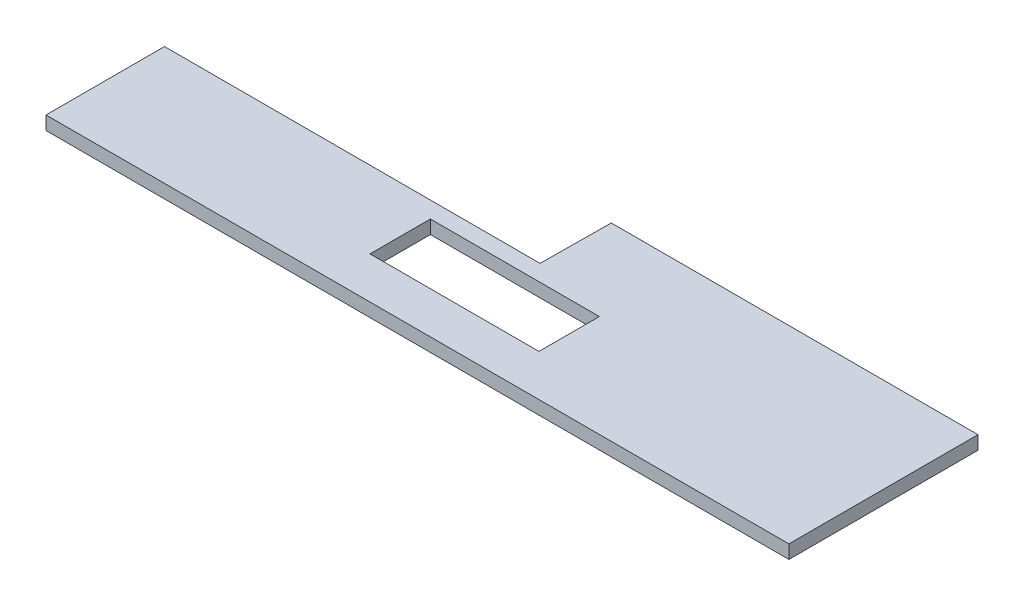
ISO-10303-21;
HEADER;
FILE_DESCRIPTION(('STEP AP214'),'2;1');
FILE_NAME('part.step','',(''),(''),'','','');
FILE_SCHEMA(('AUTOMOTIVE_DESIGN { 1 0 10303 214 1 1 1 1 }'));
ENDSEC;
DATA;
#1=APPLICATION_CONTEXT('core data for automotive mechanical design processes');
#2=APPLICATION_PROTOCOL_DEFINITION('international standard','automotive_design',2000,#1);
#3=PRODUCT_CONTEXT('',#1,'mechanical');
#4=PRODUCT('Part','Part','',(#3));
#5=PRODUCT_RELATED_PRODUCT_CATEGORY('part','',(#4));
#6=PRODUCT_DEFINITION_FORMATION('','',#4);
#7=PRODUCT_DEFINITION_CONTEXT('part definition',#1,'design');
#8=PRODUCT_DEFINITION('design','',#6,#7);
#9=PRODUCT_DEFINITION_SHAPE('','',#8);
#10=(LENGTH_UNIT() NAMED_UNIT(*) SI_UNIT(.MILLI.,.METRE.));
#11=(NAMED_UNIT(*) PLANE_ANGLE_UNIT() SI_UNIT($,.RADIAN.));
#12=(NAMED_UNIT(*) SI_UNIT($,.STERADIAN.) SOLID_ANGLE_UNIT());
#13=UNCERTAINTY_MEASURE_WITH_UNIT(LENGTH_MEASURE(1.E-05),#10,'distance_accuracy_value','');
#14=(GEOMETRIC_REPRESENTATION_CONTEXT(3) GLOBAL_UNCERTAINTY_ASSIGNED_CONTEXT((#13)) GLOBAL_UNIT_ASSIGNED_CONTEXT((#10,
#11,#12)) REPRESENTATION_CONTEXT('',''));
#15=CARTESIAN_POINT('',(0.,0.,0.));
#16=DIRECTION('',(0.,0.,1.));
#17=DIRECTION('',(1.,0.,0.));
#18=AXIS2_PLACEMENT_3D('',#15,#16,#17);
#19=CARTESIAN_POINT('',(0.,2.,0.));
#20=DIRECTION('',(0.,1.,0.));
#21=DIRECTION('',(0.,0.,1.));
#22=AXIS2_PLACEMENT_3D('',#19,#20,#21);
#23=PLANE('',#22);
#24=DIRECTION('',(0.,0.,-1.));
#25=VECTOR('',#24,1.);
#26=CARTESIAN_POINT('',(66.5436786836032,2.,-9.289945608766));
#27=LINE('',#26,#25);
#28=CARTESIAN_POINT('',(66.5436786836032,2.,18.710054391234));
#29=VERTEX_POINT('',#28);
#30=CARTESIAN_POINT('',(66.5436786836032,2.,-9.289945608766));
#31=VERTEX_POINT('',#30);
#32=EDGE_CURVE('E169',#29,#31,#27,.T.);
#33=ORIENTED_EDGE('',*,*,#32,.T.);
#34=DIRECTION('',(-1.,0.,0.));
#35=VECTOR('',#34,1.);
#36=CARTESIAN_POINT('',(12.2447054213453,2.,-9.289945608766));
#37=LINE('',#36,#35);
#38=CARTESIAN_POINT('',(12.2447054213453,2.,-9.289945608766));
#39=VERTEX_POINT('',#38);
#40=EDGE_CURVE('E173',#31,#39,#37,.T.);
#41=ORIENTED_EDGE('',*,*,#40,.T.);
#42=DIRECTION('',(-0.00921920535342441,0.,0.999957502223295));
#43=VECTOR('',#42,1.);
#44=CARTESIAN_POINT('',(12.2447054213453,2.,-9.289945608766));
#45=LINE('',#44,#43);
#46=CARTESIAN_POINT('',(12.1483393726792,2.,1.16236016262739));
#47=VERTEX_POINT('',#46);
#48=EDGE_CURVE('E177',#39,#47,#45,.T.);
#49=ORIENTED_EDGE('',*,*,#48,.T.);
#50=DIRECTION('',(-1.,0.,0.));
#51=VECTOR('',#50,1.);
#52=CARTESIAN_POINT('',(12.1483393726792,2.,1.16236016262739));
#53=LINE('',#52,#51);
#54=CARTESIAN_POINT('',(-43.4563213163968,2.,1.1623601626274));
#55=VERTEX_POINT('',#54);
#56=EDGE_CURVE('E180',#47,#55,#53,.T.);
#57=ORIENTED_EDGE('',*,*,#56,.T.);
#58=DIRECTION('',(0.,0.,1.));
#59=VECTOR('',#58,1.);
#60=CARTESIAN_POINT('',(-43.4563213163968,2.,1.1623601626274));
#61=LINE('',#60,#59);
#62=CARTESIAN_POINT('',(-43.4563213163968,2.,18.710054391234));
#63=VERTEX_POINT('',#62);
#64=EDGE_CURVE('E183',#55,#63,#61,.T.);
#65=ORIENTED_EDGE('',*,*,#64,.T.);
#66=DIRECTION('',(1.,0.,0.));
#67=VECTOR('',#66,1.);
#68=CARTESIAN_POINT('',(-43.4563213163968,2.,18.710054391234));
#69=LINE('',#68,#67);
#70=EDGE_CURVE('E186',#63,#29,#69,.T.);
#71=ORIENTED_EDGE('',*,*,#70,.T.);
#72=EDGE_LOOP('',(#33,#41,#49,#57,#65,#71));
#73=FACE_BOUND('',#72,.T.);
#74=DIRECTION('',(1.,0.,0.));
#75=VECTOR('',#74,1.);
#76=CARTESIAN_POINT('',(-1.65439007256286,2.,12.5346543297769));
#77=LINE('',#76,#75);
#78=CARTESIAN_POINT('',(-1.65439007256286,2.,12.5346543297769));
#79=VERTEX_POINT('',#78);
#80=CARTESIAN_POINT('',(23.3582538359042,2.,12.5346543297769));
#81=VERTEX_POINT('',#80);
#82=EDGE_CURVE('E130',#79,#81,#77,.T.);
#83=ORIENTED_EDGE('',*,*,#82,.F.);
#84=DIRECTION('',(0.,0.,1.));
#85=VECTOR('',#84,1.);
#86=CARTESIAN_POINT('',(-1.65439007256286,2.,3.59271568279142));
#87=LINE('',#86,#85);
#88=CARTESIAN_POINT('',(-1.65439007256286,2.,3.59271568279142));
#89=VERTEX_POINT('',#88);
#90=EDGE_CURVE('E121',#89,#79,#87,.T.);
#91=ORIENTED_EDGE('',*,*,#90,.F.);
#92=DIRECTION('',(-1.,0.,0.));
#93=VECTOR('',#92,1.);
#94=CARTESIAN_POINT('',(-1.65439007256286,2.,3.59271568279142));
#95=LINE('',#94,#93);
#96=CARTESIAN_POINT('',(23.3582538359042,2.,3.59271568279142));
#97=VERTEX_POINT('',#96);
#98=EDGE_CURVE('E147',#97,#89,#95,.T.);
#99=ORIENTED_EDGE('',*,*,#98,.F.);
#100=DIRECTION('',(0.,0.,-1.));
#101=VECTOR('',#100,1.);
#102=CARTESIAN_POINT('',(23.3582538359042,2.,3.59271568279142));
#103=LINE('',#102,#101);
#104=EDGE_CURVE('E143',#81,#97,#103,.T.);
#105=ORIENTED_EDGE('',*,*,#104,.F.);
#106=EDGE_LOOP('',(#83,#91,#99,#105));
#107=FACE_BOUND('',#106,.T.);
#108=ADVANCED_FACE('F43',(#73,#107),#23,.T.);
#109=CARTESIAN_POINT('',(0.,0.,0.));
#110=DIRECTION('',(0.,1.,0.));
#111=DIRECTION('',(0.,0.,1.));
#112=AXIS2_PLACEMENT_3D('',#109,#110,#111);
#113=PLANE('',#112);
#114=DIRECTION('',(0.,0.,-1.));
#115=VECTOR('',#114,1.);
#116=CARTESIAN_POINT('',(66.5436786836032,0.,-9.289945608766));
#117=LINE('',#116,#115);
#118=CARTESIAN_POINT('',(66.5436786836032,0.,18.710054391234));
#119=VERTEX_POINT('',#118);
#120=CARTESIAN_POINT('',(66.5436786836032,0.,-9.289945608766));
#121=VERTEX_POINT('',#120);
#122=EDGE_CURVE('E139',#119,#121,#117,.T.);
#123=ORIENTED_EDGE('',*,*,#122,.F.);
#124=DIRECTION('',(1.,0.,0.));
#125=VECTOR('',#124,1.);
#126=CARTESIAN_POINT('',(-43.4563213163968,0.,18.710054391234));
#127=LINE('',#126,#125);
#128=CARTESIAN_POINT('',(-43.4563213163968,0.,18.710054391234));
#129=VERTEX_POINT('',#128);
#130=EDGE_CURVE('E174',#129,#119,#127,.T.);
#131=ORIENTED_EDGE('',*,*,#130,.F.);
#132=DIRECTION('',(0.,0.,1.));
#133=VECTOR('',#132,1.);
#134=CARTESIAN_POINT('',(-43.4563213163968,0.,1.1623601626274));
#135=LINE('',#134,#133);
#136=CARTESIAN_POINT('',(-43.4563213163968,0.,1.1623601626274));
#137=VERTEX_POINT('',#136);
#138=EDGE_CURVE('E202',#137,#129,#135,.T.);
#139=ORIENTED_EDGE('',*,*,#138,.F.);
#140=DIRECTION('',(-1.,0.,0.));
#141=VECTOR('',#140,1.);
#142=CARTESIAN_POINT('',(12.1483393726792,0.,1.16236016262739));
#143=LINE('',#142,#141);
#144=CARTESIAN_POINT('',(12.1483393726792,0.,1.16236016262739));
#145=VERTEX_POINT('',#144);
#146=EDGE_CURVE('E199',#145,#137,#143,.T.);
#147=ORIENTED_EDGE('',*,*,#146,.F.);
#148=DIRECTION('',(-0.00921920535342441,0.,0.999957502223295));
#149=VECTOR('',#148,1.);
#150=CARTESIAN_POINT('',(12.2447054213453,0.,-9.289945608766));
#151=LINE('',#150,#149);
#152=CARTESIAN_POINT('',(12.2447054213453,0.,-9.289945608766));
#153=VERTEX_POINT('',#152);
#154=EDGE_CURVE('E196',#153,#145,#151,.T.);
#155=ORIENTED_EDGE('',*,*,#154,.F.);
#156=DIRECTION('',(-1.,0.,0.));
#157=VECTOR('',#156,1.);
#158=CARTESIAN_POINT('',(12.2447054213453,0.,-9.289945608766));
#159=LINE('',#158,#157);
#160=EDGE_CURVE('E193',#121,#153,#159,.T.);
#161=ORIENTED_EDGE('',*,*,#160,.F.);
#162=EDGE_LOOP('',(#123,#131,#139,#147,#155,#161));
#163=FACE_BOUND('',#162,.T.);
#164=DIRECTION('',(0.,0.,1.));
#165=VECTOR('',#164,1.);
#166=CARTESIAN_POINT('',(-1.65439007256286,0.,3.59271568279142));
#167=LINE('',#166,#165);
#168=CARTESIAN_POINT('',(-1.65439007256286,0.,3.59271568279142));
#169=VERTEX_POINT('',#168);
#170=CARTESIAN_POINT('',(-1.65439007256286,0.,12.5346543297769));
#171=VERTEX_POINT('',#170);
#172=EDGE_CURVE('E67',#169,#171,#167,.T.);
#173=ORIENTED_EDGE('',*,*,#172,.T.);
#174=DIRECTION('',(1.,0.,0.));
#175=VECTOR('',#174,1.);
#176=CARTESIAN_POINT('',(-1.65439007256286,0.,12.5346543297769));
#177=LINE('',#176,#175);
#178=CARTESIAN_POINT('',(23.3582538359042,0.,12.5346543297769));
#179=VERTEX_POINT('',#178);
#180=EDGE_CURVE('E137',#171,#179,#177,.T.);
#181=ORIENTED_EDGE('',*,*,#180,.T.);
#182=DIRECTION('',(0.,0.,-1.));
#183=VECTOR('',#182,1.);
#184=CARTESIAN_POINT('',(23.3582538359042,0.,3.59271568279142));
#185=LINE('',#184,#183);
#186=CARTESIAN_POINT('',(23.3582538359042,0.,3.59271568279142));
#187=VERTEX_POINT('',#186);
#188=EDGE_CURVE('E156',#179,#187,#185,.T.);
#189=ORIENTED_EDGE('',*,*,#188,.T.);
#190=DIRECTION('',(-1.,0.,0.));
#191=VECTOR('',#190,1.);
#192=CARTESIAN_POINT('',(-1.65439007256286,0.,3.59271568279142));
#193=LINE('',#192,#191);
#194=EDGE_CURVE('E131',#187,#169,#193,.T.);
#195=ORIENTED_EDGE('',*,*,#194,.T.);
#196=EDGE_LOOP('',(#173,#181,#189,#195));
#197=FACE_BOUND('',#196,.T.);
#198=ADVANCED_FACE('F233',(#163,#197),#113,.F.);
#199=CARTESIAN_POINT('',(66.5436786836032,2.,-9.289945608766));
#200=DIRECTION('',(-1.,0.,0.));
#201=DIRECTION('',(0.,0.,1.));
#202=AXIS2_PLACEMENT_3D('',#199,#200,#201);
#203=PLANE('',#202);
#204=ORIENTED_EDGE('',*,*,#122,.T.);
#205=DIRECTION('',(0.,-1.,0.));
#206=VECTOR('',#205,1.);
#207=CARTESIAN_POINT('',(66.5436786836032,2.,-9.289945608766));
#208=LINE('',#207,#206);
#209=EDGE_CURVE('E11',#31,#121,#208,.T.);
#210=ORIENTED_EDGE('',*,*,#209,.F.);
#211=ORIENTED_EDGE('',*,*,#32,.F.);
#212=DIRECTION('',(0.,-1.,0.));
#213=VECTOR('',#212,1.);
#214=CARTESIAN_POINT('',(66.5436786836032,2.,18.710054391234));
#215=LINE('',#214,#213);
#216=EDGE_CURVE('E189',#29,#119,#215,.T.);
#217=ORIENTED_EDGE('',*,*,#216,.T.);
#218=EDGE_LOOP('',(#204,#210,#211,#217));
#219=FACE_BOUND('',#218,.T.);
#220=ADVANCED_FACE('F45',(#219),#203,.F.);
#221=CARTESIAN_POINT('',(12.2447054213453,2.,-9.289945608766));
#222=DIRECTION('',(0.,0.,1.));
#223=DIRECTION('',(1.,0.,0.));
#224=AXIS2_PLACEMENT_3D('',#221,#222,#223);
#225=PLANE('',#224);
#226=ORIENTED_EDGE('',*,*,#160,.T.);
#227=DIRECTION('',(0.,-1.,0.));
#228=VECTOR('',#227,1.);
#229=CARTESIAN_POINT('',(12.2447054213453,2.,-9.289945608766));
#230=LINE('',#229,#228);
#231=EDGE_CURVE('E52',#39,#153,#230,.T.);
#232=ORIENTED_EDGE('',*,*,#231,.F.);
#233=ORIENTED_EDGE('',*,*,#40,.F.);
#234=ORIENTED_EDGE('',*,*,#209,.T.);
#235=EDGE_LOOP('',(#226,#232,#233,#234));
#236=FACE_BOUND('',#235,.T.);
#237=ADVANCED_FACE('F250',(#236),#225,.F.);
#238=CARTESIAN_POINT('',(12.2447054213453,2.,-9.289945608766));
#239=DIRECTION('',(0.999957502223295,0.,0.00921920535342441));
#240=DIRECTION('',(0.00921920535342441,0.,-0.999957502223295));
#241=AXIS2_PLACEMENT_3D('',#238,#239,#240);
#242=PLANE('',#241);
#243=ORIENTED_EDGE('',*,*,#154,.T.);
#244=DIRECTION('',(0.,-1.,0.));
#245=VECTOR('',#244,1.);
#246=CARTESIAN_POINT('',(12.1483393726792,2.,1.16236016262739));
#247=LINE('',#246,#245);
#248=EDGE_CURVE('E218',#47,#145,#247,.T.);
#249=ORIENTED_EDGE('',*,*,#248,.F.);
#250=ORIENTED_EDGE('',*,*,#48,.F.);
#251=ORIENTED_EDGE('',*,*,#231,.T.);
#252=EDGE_LOOP('',(#243,#249,#250,#251));
#253=FACE_BOUND('',#252,.T.);
#254=ADVANCED_FACE('F227',(#253),#242,.F.);
#255=CARTESIAN_POINT('',(12.1483393726792,2.,1.16236016262739));
#256=DIRECTION('',(0.,0.,1.));
#257=DIRECTION('',(1.,0.,0.));
#258=AXIS2_PLACEMENT_3D('',#255,#256,#257);
#259=PLANE('',#258);
#260=ORIENTED_EDGE('',*,*,#146,.T.);
#261=DIRECTION('',(0.,-1.,0.));
#262=VECTOR('',#261,1.);
#263=CARTESIAN_POINT('',(-43.4563213163968,2.,1.1623601626274));
#264=LINE('',#263,#262);
#265=EDGE_CURVE('E214',#55,#137,#264,.T.);
#266=ORIENTED_EDGE('',*,*,#265,.F.);
#267=ORIENTED_EDGE('',*,*,#56,.F.);
#268=ORIENTED_EDGE('',*,*,#248,.T.);
#269=EDGE_LOOP('',(#260,#266,#267,#268));
#270=FACE_BOUND('',#269,.T.);
#271=ADVANCED_FACE('F239',(#270),#259,.F.);
#272=CARTESIAN_POINT('',(-43.4563213163968,2.,1.1623601626274));
#273=DIRECTION('',(1.,0.,0.));
#274=DIRECTION('',(0.,0.,-1.));
#275=AXIS2_PLACEMENT_3D('',#272,#273,#274);
#276=PLANE('',#275);
#277=ORIENTED_EDGE('',*,*,#138,.T.);
#278=DIRECTION('',(0.,-1.,0.));
#279=VECTOR('',#278,1.);
#280=CARTESIAN_POINT('',(-43.4563213163968,2.,18.710054391234));
#281=LINE('',#280,#279);
#282=EDGE_CURVE('E210',#63,#129,#281,.T.);
#283=ORIENTED_EDGE('',*,*,#282,.F.);
#284=ORIENTED_EDGE('',*,*,#64,.F.);
#285=ORIENTED_EDGE('',*,*,#265,.T.);
#286=EDGE_LOOP('',(#277,#283,#284,#285));
#287=FACE_BOUND('',#286,.T.);
#288=ADVANCED_FACE('F243',(#287),#276,.F.);
#289=CARTESIAN_POINT('',(-43.4563213163968,2.,18.710054391234));
#290=DIRECTION('',(0.,0.,-1.));
#291=DIRECTION('',(-1.,0.,0.));
#292=AXIS2_PLACEMENT_3D('',#289,#290,#291);
#293=PLANE('',#292);
#294=ORIENTED_EDGE('',*,*,#130,.T.);
#295=ORIENTED_EDGE('',*,*,#216,.F.);
#296=ORIENTED_EDGE('',*,*,#70,.F.);
#297=ORIENTED_EDGE('',*,*,#282,.T.);
#298=EDGE_LOOP('',(#294,#295,#296,#297));
#299=FACE_BOUND('',#298,.T.);
#300=ADVANCED_FACE('F253',(#299),#293,.F.);
#301=CARTESIAN_POINT('',(-1.65439007256286,2.,3.59271568279142));
#302=DIRECTION('',(1.,0.,0.));
#303=DIRECTION('',(0.,0.,-1.));
#304=AXIS2_PLACEMENT_3D('',#301,#302,#303);
#305=PLANE('',#304);
#306=ORIENTED_EDGE('',*,*,#172,.F.);
#307=DIRECTION('',(0.,-1.,0.));
#308=VECTOR('',#307,1.);
#309=CARTESIAN_POINT('',(-1.65439007256286,2.,3.59271568279142));
#310=LINE('',#309,#308);
#311=EDGE_CURVE('E125',#89,#169,#310,.T.);
#312=ORIENTED_EDGE('',*,*,#311,.F.);
#313=ORIENTED_EDGE('',*,*,#90,.T.);
#314=DIRECTION('',(0.,-1.,0.));
#315=VECTOR('',#314,1.);
#316=CARTESIAN_POINT('',(-1.65439007256286,2.,12.5346543297769));
#317=LINE('',#316,#315);
#318=EDGE_CURVE('E124',#79,#171,#317,.T.);
#319=ORIENTED_EDGE('',*,*,#318,.T.);
#320=EDGE_LOOP('',(#306,#312,#313,#319));
#321=FACE_BOUND('',#320,.T.);
#322=ADVANCED_FACE('F123',(#321),#305,.T.);
#323=CARTESIAN_POINT('',(-1.65439007256286,2.,12.5346543297769));
#324=DIRECTION('',(0.,0.,-1.));
#325=DIRECTION('',(-1.,0.,0.));
#326=AXIS2_PLACEMENT_3D('',#323,#324,#325);
#327=PLANE('',#326);
#328=ORIENTED_EDGE('',*,*,#180,.F.);
#329=ORIENTED_EDGE('',*,*,#318,.F.);
#330=ORIENTED_EDGE('',*,*,#82,.T.);
#331=DIRECTION('',(0.,-1.,0.));
#332=VECTOR('',#331,1.);
#333=CARTESIAN_POINT('',(23.3582538359042,2.,12.5346543297769));
#334=LINE('',#333,#332);
#335=EDGE_CURVE('E140',#81,#179,#334,.T.);
#336=ORIENTED_EDGE('',*,*,#335,.T.);
#337=EDGE_LOOP('',(#328,#329,#330,#336));
#338=FACE_BOUND('',#337,.T.);
#339=ADVANCED_FACE('F134',(#338),#327,.T.);
#340=CARTESIAN_POINT('',(23.3582538359042,2.,3.59271568279142));
#341=DIRECTION('',(-1.,0.,0.));
#342=DIRECTION('',(0.,0.,1.));
#343=AXIS2_PLACEMENT_3D('',#340,#341,#342);
#344=PLANE('',#343);
#345=ORIENTED_EDGE('',*,*,#188,.F.);
#346=ORIENTED_EDGE('',*,*,#335,.F.);
#347=ORIENTED_EDGE('',*,*,#104,.T.);
#348=DIRECTION('',(0.,-1.,0.));
#349=VECTOR('',#348,1.);
#350=CARTESIAN_POINT('',(23.3582538359042,2.,3.59271568279142));
#351=LINE('',#350,#349);
#352=EDGE_CURVE('E59',#97,#187,#351,.T.);
#353=ORIENTED_EDGE('',*,*,#352,.T.);
#354=EDGE_LOOP('',(#345,#346,#347,#353));
#355=FACE_BOUND('',#354,.T.);
#356=ADVANCED_FACE('F271',(#355),#344,.T.);
#357=CARTESIAN_POINT('',(-1.65439007256286,2.,3.59271568279142));
#358=DIRECTION('',(0.,0.,1.));
#359=DIRECTION('',(1.,0.,0.));
#360=AXIS2_PLACEMENT_3D('',#357,#358,#359);
#361=PLANE('',#360);
#362=ORIENTED_EDGE('',*,*,#194,.F.);
#363=ORIENTED_EDGE('',*,*,#352,.F.);
#364=ORIENTED_EDGE('',*,*,#98,.T.);
#365=ORIENTED_EDGE('',*,*,#311,.T.);
#366=EDGE_LOOP('',(#362,#363,#364,#365));
#367=FACE_BOUND('',#366,.T.);
#368=ADVANCED_FACE('F274',(#367),#361,.T.);
#369=CLOSED_SHELL('',(#108,#198,#220,#237,#254,#271,#288,#300,#322,#339,#356,#368));
#370=MANIFOLD_SOLID_BREP('B2',#369);
#371=ADVANCED_BREP_SHAPE_REPRESENTATION('',(#18,#370),#14);
#372=SHAPE_DEFINITION_REPRESENTATION(#9,#371);
ENDSEC;
END-ISO-10303-21;
